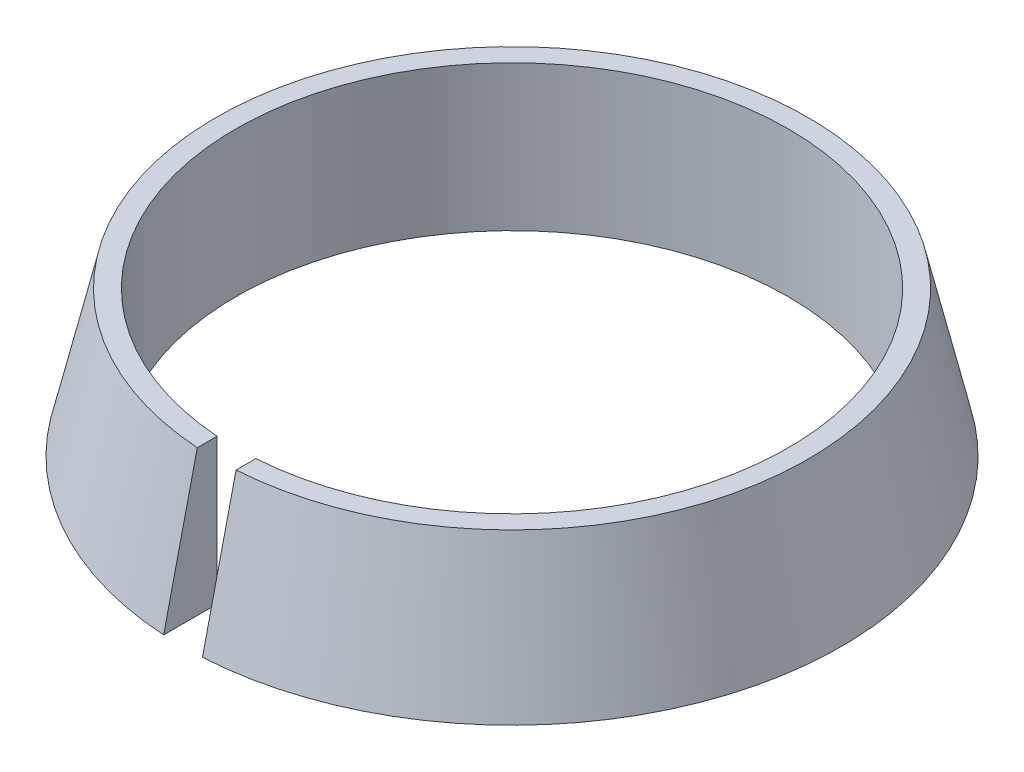
ISO-10303-21;
HEADER;
FILE_DESCRIPTION(('STEP AP214'),'2;1');
FILE_NAME('part.step','',(''),(''),'','','');
FILE_SCHEMA(('AUTOMOTIVE_DESIGN { 1 0 10303 214 1 1 1 1 }'));
ENDSEC;
DATA;
#1=APPLICATION_CONTEXT('core data for automotive mechanical design processes');
#2=APPLICATION_PROTOCOL_DEFINITION('international standard','automotive_design',2000,#1);
#3=PRODUCT_CONTEXT('',#1,'mechanical');
#4=PRODUCT('Part','Part','',(#3));
#5=PRODUCT_RELATED_PRODUCT_CATEGORY('part','',(#4));
#6=PRODUCT_DEFINITION_FORMATION('','',#4);
#7=PRODUCT_DEFINITION_CONTEXT('part definition',#1,'design');
#8=PRODUCT_DEFINITION('design','',#6,#7);
#9=PRODUCT_DEFINITION_SHAPE('','',#8);
#10=(LENGTH_UNIT() NAMED_UNIT(*) SI_UNIT(.MILLI.,.METRE.));
#11=(NAMED_UNIT(*) PLANE_ANGLE_UNIT() SI_UNIT($,.RADIAN.));
#12=(NAMED_UNIT(*) SI_UNIT($,.STERADIAN.) SOLID_ANGLE_UNIT());
#13=UNCERTAINTY_MEASURE_WITH_UNIT(LENGTH_MEASURE(1.E-05),#10,'distance_accuracy_value','');
#14=(GEOMETRIC_REPRESENTATION_CONTEXT(3) GLOBAL_UNCERTAINTY_ASSIGNED_CONTEXT((#13)) GLOBAL_UNIT_ASSIGNED_CONTEXT((#10,
#11,#12)) REPRESENTATION_CONTEXT('',''));
#15=CARTESIAN_POINT('',(0.,0.,0.));
#16=DIRECTION('',(0.,0.,1.));
#17=DIRECTION('',(1.,0.,0.));
#18=AXIS2_PLACEMENT_3D('',#15,#16,#17);
#19=CARTESIAN_POINT('',(14.25,0.,0.));
#20=DIRECTION('',(0.,-1.,0.));
#21=DIRECTION('',(0.,0.,-1.));
#22=AXIS2_PLACEMENT_3D('',#19,#20,#21);
#23=PLANE('',#22);
#24=CARTESIAN_POINT('',(0.,0.,0.));
#25=DIRECTION('',(0.,-1.,0.));
#26=DIRECTION('',(0.,0.,-1.));
#27=AXIS2_PLACEMENT_3D('',#24,#25,#26);
#28=CIRCLE('',#27,14.25);
#29=CARTESIAN_POINT('',(-1.,0.,14.2148689758295));
#30=VERTEX_POINT('',#29);
#31=CARTESIAN_POINT('',(1.,0.,14.2148689758295));
#32=VERTEX_POINT('',#31);
#33=EDGE_CURVE('E80',#30,#32,#28,.T.);
#34=ORIENTED_EDGE('',*,*,#33,.F.);
#35=DIRECTION('',(0.,0.,-1.));
#36=VECTOR('',#35,1.);
#37=CARTESIAN_POINT('',(-1.,0.,17.));
#38=LINE('',#37,#36);
#39=CARTESIAN_POINT('',(-1.,0.,16.9705627484772));
#40=VERTEX_POINT('',#39);
#41=EDGE_CURVE('E48',#40,#30,#38,.T.);
#42=ORIENTED_EDGE('',*,*,#41,.F.);
#43=CARTESIAN_POINT('',(0.,0.,0.));
#44=DIRECTION('',(0.,-1.,0.));
#45=DIRECTION('',(0.,0.,-1.));
#46=AXIS2_PLACEMENT_3D('',#43,#44,#45);
#47=CIRCLE('',#46,17.);
#48=CARTESIAN_POINT('',(0.999999999999997,0.,16.9705627484772));
#49=VERTEX_POINT('',#48);
#50=EDGE_CURVE('E79',#40,#49,#47,.T.);
#51=ORIENTED_EDGE('',*,*,#50,.T.);
#52=DIRECTION('',(0.,0.,-1.));
#53=VECTOR('',#52,1.);
#54=CARTESIAN_POINT('',(0.999999999999998,0.,17.));
#55=LINE('',#54,#53);
#56=EDGE_CURVE('E95',#49,#32,#55,.T.);
#57=ORIENTED_EDGE('',*,*,#56,.T.);
#58=EDGE_LOOP('',(#34,#42,#51,#57));
#59=FACE_BOUND('',#58,.T.);
#60=ADVANCED_FACE('F26',(#59),#23,.T.);
#61=CARTESIAN_POINT('',(0.,0.,0.));
#62=DIRECTION('',(0.,-1.,0.));
#63=DIRECTION('',(0.,0.,-1.));
#64=AXIS2_PLACEMENT_3D('',#61,#62,#63);
#65=CONICAL_SURFACE('',#64,17.,0.226892802759263);
#66=ORIENTED_EDGE('',*,*,#50,.F.);
#67=CARTESIAN_POINT('',(-0.999999999999998,-23.9803028543849,22.5140917720536));
#68=CARTESIAN_POINT('',(-0.999999999999999,-19.6101743718046,21.5041532224328));
#69=CARTESIAN_POINT('',(-1.,-15.2400669114172,20.4941236437249));
#70=CARTESIAN_POINT('',(-1.,-6.49994497198938,18.4736628855568));
#71=CARTESIAN_POINT('',(-1.,-2.12993049294622,17.4632317061087));
#72=CARTESIAN_POINT('',(-1.,6.60995494133729,15.4417481127148));
#73=CARTESIAN_POINT('',(-1.,10.9798258965734,14.4306956987505));
#74=CARTESIAN_POINT('',(-1.,17.5344317103477,12.9132500990459));
#75=CARTESIAN_POINT('',(-1.,19.7192669118601,12.4072903949351));
#76=CARTESIAN_POINT('',(-1.,24.0888361336574,11.3949341296258));
#77=CARTESIAN_POINT('',(-1.,26.2735701539405,10.8885375684203));
#78=CARTESIAN_POINT('',(-1.,28.4582364060505,10.3818486520221));
#79=B_SPLINE_CURVE_WITH_KNOTS('',3,(#67,#68,#69,#70,#71,#72,#73,#74,#75,#76,#77,#78),
.UNSPECIFIED.,.F.,.F.,(4,2,2,2,2,4),(0.,13.4559276886125,26.9118549696335,40.3677826501794,
47.0957466963765,53.8237108491352),.UNSPECIFIED.);
#80=CARTESIAN_POINT('',(-1.,7.5,15.235706189971));
#81=VERTEX_POINT('',#80);
#82=EDGE_CURVE('E66',#40,#81,#79,.T.);
#83=ORIENTED_EDGE('',*,*,#82,.T.);
#84=CARTESIAN_POINT('',(0.,7.5,0.));
#85=DIRECTION('',(0.,-1.,0.));
#86=DIRECTION('',(0.,0.,-1.));
#87=AXIS2_PLACEMENT_3D('',#84,#85,#86);
#88=CIRCLE('',#87,15.2684885665583);
#89=CARTESIAN_POINT('',(1.,7.5,15.235706189971));
#90=VERTEX_POINT('',#89);
#91=EDGE_CURVE('E77',#81,#90,#88,.T.);
#92=ORIENTED_EDGE('',*,*,#91,.T.);
#93=CARTESIAN_POINT('',(1.,28.4582364060505,10.3818486520221));
#94=CARTESIAN_POINT('',(0.999999999999995,25.6934386190385,11.0230707244486));
#95=CARTESIAN_POINT('',(0.999999999999996,22.9285376690979,11.6638476795931));
#96=CARTESIAN_POINT('',(1.,17.3985879464497,12.9447631749982));
#97=CARTESIAN_POINT('',(1.,14.6335391737454,13.584901715273));
#98=CARTESIAN_POINT('',(1.,10.2637336269253,14.5962368977518));
#99=CARTESIAN_POINT('',(0.999999999999999,8.65900651204772,14.9675617250675));
#100=CARTESIAN_POINT('',(0.999999999999997,5.44952691676191,15.7101017956478));
#101=CARTESIAN_POINT('',(0.999999999999998,3.84477443635354,16.0813170389118));
#102=CARTESIAN_POINT('',(0.999999999999999,-2.1299300598776,17.463234061542));
#103=CARTESIAN_POINT('',(0.999999999999999,-6.49994492419408,18.4736641022744));
#104=CARTESIAN_POINT('',(0.999999999999998,-15.2400674091862,20.4941225309966));
#105=CARTESIAN_POINT('',(0.999999999999997,-19.6101750298599,21.5041509189949));
#106=CARTESIAN_POINT('',(0.999999999999997,-23.9803028543849,22.5140917720536));
#107=B_SPLINE_CURVE_WITH_KNOTS('',3,(#93,#94,#95,#96,#97,#98,#99,#100,#101,#102,#103,#104,#105,
#106),.UNSPECIFIED.,.F.,.F.,(4,2,2,2,2,2,4),(0.,8.5145434812457,17.0290867724827,
21.970471311585,26.9118558827728,40.3677835101688,53.8237108524062),.UNSPECIFIED.);
#108=EDGE_CURVE('E81',#90,#49,#107,.T.);
#109=ORIENTED_EDGE('',*,*,#108,.T.);
#110=EDGE_LOOP('',(#66,#83,#92,#109));
#111=FACE_BOUND('',#110,.T.);
#112=ADVANCED_FACE('F75',(#111),#65,.T.);
#113=CARTESIAN_POINT('',(15.2684885665583,7.5,0.));
#114=DIRECTION('',(0.,1.,0.));
#115=DIRECTION('',(0.,0.,1.));
#116=AXIS2_PLACEMENT_3D('',#113,#114,#115);
#117=PLANE('',#116);
#118=ORIENTED_EDGE('',*,*,#91,.F.);
#119=DIRECTION('',(0.,0.,-1.));
#120=VECTOR('',#119,1.);
#121=CARTESIAN_POINT('',(-1.,7.5,17.));
#122=LINE('',#121,#120);
#123=CARTESIAN_POINT('',(-1.,7.5,14.2148689758295));
#124=VERTEX_POINT('',#123);
#125=EDGE_CURVE('E63',#81,#124,#122,.T.);
#126=ORIENTED_EDGE('',*,*,#125,.T.);
#127=CARTESIAN_POINT('',(0.,7.5,0.));
#128=DIRECTION('',(0.,-1.,0.));
#129=DIRECTION('',(0.,0.,-1.));
#130=AXIS2_PLACEMENT_3D('',#127,#128,#129);
#131=CIRCLE('',#130,14.25);
#132=CARTESIAN_POINT('',(1.,7.5,14.2148689758295));
#133=VERTEX_POINT('',#132);
#134=EDGE_CURVE('E84',#124,#133,#131,.T.);
#135=ORIENTED_EDGE('',*,*,#134,.T.);
#136=DIRECTION('',(0.,0.,-1.));
#137=VECTOR('',#136,1.);
#138=CARTESIAN_POINT('',(0.999999999999998,7.5,17.));
#139=LINE('',#138,#137);
#140=EDGE_CURVE('E40',#90,#133,#139,.T.);
#141=ORIENTED_EDGE('',*,*,#140,.F.);
#142=EDGE_LOOP('',(#118,#126,#135,#141));
#143=FACE_BOUND('',#142,.T.);
#144=ADVANCED_FACE('F83',(#143),#117,.T.);
#145=CARTESIAN_POINT('',(0.,-11.2328924162258,0.));
#146=DIRECTION('',(0.,-1.,0.));
#147=DIRECTION('',(0.,0.,-1.));
#148=AXIS2_PLACEMENT_3D('',#145,#146,#147);
#149=CYLINDRICAL_SURFACE('',#148,14.25);
#150=ORIENTED_EDGE('',*,*,#134,.F.);
#151=DIRECTION('',(0.,-1.,0.));
#152=VECTOR('',#151,1.);
#153=CARTESIAN_POINT('',(-1.,-11.2328924162258,14.2148689758295));
#154=LINE('',#153,#152);
#155=EDGE_CURVE('E11',#124,#30,#154,.T.);
#156=ORIENTED_EDGE('',*,*,#155,.T.);
#157=ORIENTED_EDGE('',*,*,#33,.T.);
#158=DIRECTION('',(0.,-1.,0.));
#159=VECTOR('',#158,1.);
#160=CARTESIAN_POINT('',(1.,-11.2328924162258,14.2148689758295));
#161=LINE('',#160,#159);
#162=EDGE_CURVE('E33',#32,#133,#161,.F.);
#163=ORIENTED_EDGE('',*,*,#162,.T.);
#164=EDGE_LOOP('',(#150,#156,#157,#163));
#165=FACE_BOUND('',#164,.T.);
#166=ADVANCED_FACE('F91',(#165),#149,.F.);
#167=CARTESIAN_POINT('',(0.999999999999998,0.,17.));
#168=DIRECTION('',(-1.,0.,0.));
#169=DIRECTION('',(0.,0.,1.));
#170=AXIS2_PLACEMENT_3D('',#167,#168,#169);
#171=PLANE('',#170);
#172=ORIENTED_EDGE('',*,*,#140,.T.);
#173=ORIENTED_EDGE('',*,*,#162,.F.);
#174=ORIENTED_EDGE('',*,*,#56,.F.);
#175=ORIENTED_EDGE('',*,*,#108,.F.);
#176=EDGE_LOOP('',(#172,#173,#174,#175));
#177=FACE_BOUND('',#176,.T.);
#178=ADVANCED_FACE('F94',(#177),#171,.T.);
#179=CARTESIAN_POINT('',(-1.,0.,17.));
#180=DIRECTION('',(1.,0.,0.));
#181=DIRECTION('',(0.,0.,-1.));
#182=AXIS2_PLACEMENT_3D('',#179,#180,#181);
#183=PLANE('',#182);
#184=ORIENTED_EDGE('',*,*,#41,.T.);
#185=ORIENTED_EDGE('',*,*,#155,.F.);
#186=ORIENTED_EDGE('',*,*,#125,.F.);
#187=ORIENTED_EDGE('',*,*,#82,.F.);
#188=EDGE_LOOP('',(#184,#185,#186,#187));
#189=FACE_BOUND('',#188,.T.);
#190=ADVANCED_FACE('F65',(#189),#183,.T.);
#191=CLOSED_SHELL('',(#60,#112,#144,#166,#178,#190));
#192=MANIFOLD_SOLID_BREP('B2',#191);
#193=ADVANCED_BREP_SHAPE_REPRESENTATION('',(#18,#192),#14);
#194=SHAPE_DEFINITION_REPRESENTATION(#9,#193);
ENDSEC;
END-ISO-10303-21;
